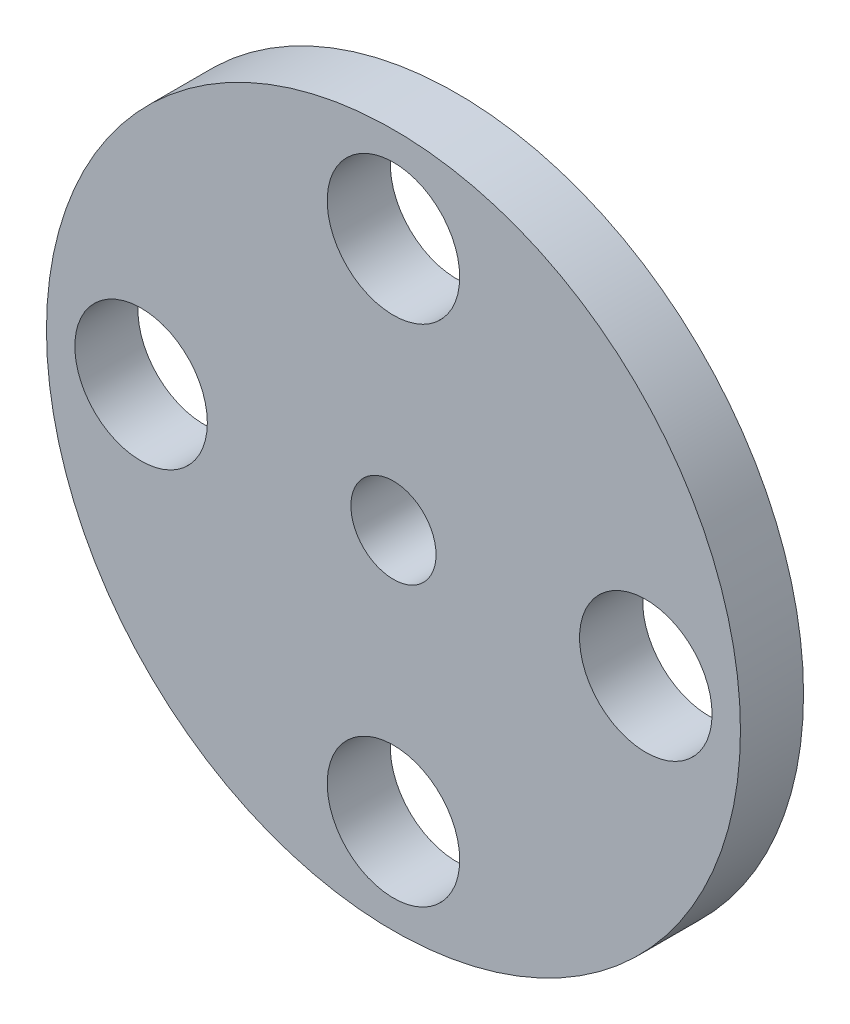
ISO-10303-21;
HEADER;
FILE_DESCRIPTION(('STEP AP214'),'2;1');
FILE_NAME('part.step','',(''),(''),'','','');
FILE_SCHEMA(('AUTOMOTIVE_DESIGN { 1 0 10303 214 1 1 1 1 }'));
ENDSEC;
DATA;
#1=APPLICATION_CONTEXT('core data for automotive mechanical design processes');
#2=APPLICATION_PROTOCOL_DEFINITION('international standard','automotive_design',2000,#1);
#3=PRODUCT_CONTEXT('',#1,'mechanical');
#4=PRODUCT('Part','Part','',(#3));
#5=PRODUCT_RELATED_PRODUCT_CATEGORY('part','',(#4));
#6=PRODUCT_DEFINITION_FORMATION('','',#4);
#7=PRODUCT_DEFINITION_CONTEXT('part definition',#1,'design');
#8=PRODUCT_DEFINITION('design','',#6,#7);
#9=PRODUCT_DEFINITION_SHAPE('','',#8);
#10=(LENGTH_UNIT() NAMED_UNIT(*) SI_UNIT(.MILLI.,.METRE.));
#11=(NAMED_UNIT(*) PLANE_ANGLE_UNIT() SI_UNIT($,.RADIAN.));
#12=(NAMED_UNIT(*) SI_UNIT($,.STERADIAN.) SOLID_ANGLE_UNIT());
#13=UNCERTAINTY_MEASURE_WITH_UNIT(LENGTH_MEASURE(1.E-05),#10,'distance_accuracy_value','');
#14=(GEOMETRIC_REPRESENTATION_CONTEXT(3) GLOBAL_UNCERTAINTY_ASSIGNED_CONTEXT((#13)) GLOBAL_UNIT_ASSIGNED_CONTEXT((#10,
#11,#12)) REPRESENTATION_CONTEXT('',''));
#15=CARTESIAN_POINT('',(0.,0.,0.));
#16=DIRECTION('',(0.,0.,1.));
#17=DIRECTION('',(1.,0.,0.));
#18=AXIS2_PLACEMENT_3D('',#15,#16,#17);
#19=CARTESIAN_POINT('',(0.,0.,2.));
#20=DIRECTION('',(0.,0.,1.));
#21=DIRECTION('',(1.,0.,0.));
#22=AXIS2_PLACEMENT_3D('',#19,#20,#21);
#23=PLANE('',#22);
#24=CARTESIAN_POINT('',(-8.00000000000001,0.,2.));
#25=DIRECTION('',(0.,0.,1.));
#26=DIRECTION('',(1.,0.,0.));
#27=AXIS2_PLACEMENT_3D('',#24,#25,#26);
#28=CIRCLE('',#27,2.1);
#29=CARTESIAN_POINT('',(-5.90000000000001,0.,2.));
#30=VERTEX_POINT('',#29);
#31=EDGE_CURVE('E58',#30,#30,#28,.T.);
#32=ORIENTED_EDGE('',*,*,#31,.F.);
#33=EDGE_LOOP('',(#32));
#34=FACE_BOUND('',#33,.T.);
#35=CARTESIAN_POINT('',(8.00000000000001,0.,2.));
#36=DIRECTION('',(0.,0.,1.));
#37=DIRECTION('',(1.,0.,0.));
#38=AXIS2_PLACEMENT_3D('',#35,#36,#37);
#39=CIRCLE('',#38,2.1);
#40=CARTESIAN_POINT('',(10.1,0.,2.));
#41=VERTEX_POINT('',#40);
#42=EDGE_CURVE('E46',#41,#41,#39,.T.);
#43=ORIENTED_EDGE('',*,*,#42,.F.);
#44=EDGE_LOOP('',(#43));
#45=FACE_BOUND('',#44,.T.);
#46=CARTESIAN_POINT('',(0.,0.,2.));
#47=DIRECTION('',(0.,0.,1.));
#48=DIRECTION('',(1.,0.,0.));
#49=AXIS2_PLACEMENT_3D('',#46,#47,#48);
#50=CIRCLE('',#49,11.0000000000001);
#51=CARTESIAN_POINT('',(11.0000000000001,0.,2.));
#52=VERTEX_POINT('',#51);
#53=EDGE_CURVE('E10',#52,#52,#50,.T.);
#54=ORIENTED_EDGE('',*,*,#53,.T.);
#55=EDGE_LOOP('',(#54));
#56=FACE_BOUND('',#55,.T.);
#57=CARTESIAN_POINT('',(0.,8.00000000000001,2.));
#58=DIRECTION('',(0.,0.,1.));
#59=DIRECTION('',(1.,0.,0.));
#60=AXIS2_PLACEMENT_3D('',#57,#58,#59);
#61=CIRCLE('',#60,2.1);
#62=CARTESIAN_POINT('',(2.1,8.00000000000001,2.));
#63=VERTEX_POINT('',#62);
#64=EDGE_CURVE('E41',#63,#63,#61,.T.);
#65=ORIENTED_EDGE('',*,*,#64,.F.);
#66=EDGE_LOOP('',(#65));
#67=FACE_BOUND('',#66,.T.);
#68=CARTESIAN_POINT('',(0.,-8.00000000000001,2.));
#69=DIRECTION('',(0.,0.,1.));
#70=DIRECTION('',(1.,0.,0.));
#71=AXIS2_PLACEMENT_3D('',#68,#69,#70);
#72=CIRCLE('',#71,2.1);
#73=CARTESIAN_POINT('',(2.1,-8.00000000000001,2.));
#74=VERTEX_POINT('',#73);
#75=EDGE_CURVE('E52',#74,#74,#72,.T.);
#76=ORIENTED_EDGE('',*,*,#75,.F.);
#77=EDGE_LOOP('',(#76));
#78=FACE_BOUND('',#77,.T.);
#79=CARTESIAN_POINT('',(0.,0.,2.));
#80=DIRECTION('',(0.,0.,1.));
#81=DIRECTION('',(1.,0.,0.));
#82=AXIS2_PLACEMENT_3D('',#79,#80,#81);
#83=CIRCLE('',#82,1.35);
#84=CARTESIAN_POINT('',(1.35,0.,2.));
#85=VERTEX_POINT('',#84);
#86=EDGE_CURVE('E64',#85,#85,#83,.T.);
#87=ORIENTED_EDGE('',*,*,#86,.F.);
#88=EDGE_LOOP('',(#87));
#89=FACE_BOUND('',#88,.T.);
#90=ADVANCED_FACE('F30',(#34,#45,#56,#67,#78,#89),#23,.T.);
#91=CARTESIAN_POINT('',(0.,0.,0.));
#92=DIRECTION('',(0.,0.,1.));
#93=DIRECTION('',(1.,0.,0.));
#94=AXIS2_PLACEMENT_3D('',#91,#92,#93);
#95=PLANE('',#94);
#96=CARTESIAN_POINT('',(-8.00000000000001,0.,0.));
#97=DIRECTION('',(0.,0.,1.));
#98=DIRECTION('',(1.,0.,0.));
#99=AXIS2_PLACEMENT_3D('',#96,#97,#98);
#100=CIRCLE('',#99,2.1);
#101=CARTESIAN_POINT('',(-5.90000000000001,0.,0.));
#102=VERTEX_POINT('',#101);
#103=EDGE_CURVE('E61',#102,#102,#100,.T.);
#104=ORIENTED_EDGE('',*,*,#103,.T.);
#105=EDGE_LOOP('',(#104));
#106=FACE_BOUND('',#105,.T.);
#107=CARTESIAN_POINT('',(8.00000000000001,0.,0.));
#108=DIRECTION('',(0.,0.,1.));
#109=DIRECTION('',(1.,0.,0.));
#110=AXIS2_PLACEMENT_3D('',#107,#108,#109);
#111=CIRCLE('',#110,2.1);
#112=CARTESIAN_POINT('',(10.1,0.,0.));
#113=VERTEX_POINT('',#112);
#114=EDGE_CURVE('E49',#113,#113,#111,.T.);
#115=ORIENTED_EDGE('',*,*,#114,.T.);
#116=EDGE_LOOP('',(#115));
#117=FACE_BOUND('',#116,.T.);
#118=CARTESIAN_POINT('',(0.,0.,0.));
#119=DIRECTION('',(0.,0.,1.));
#120=DIRECTION('',(1.,0.,0.));
#121=AXIS2_PLACEMENT_3D('',#118,#119,#120);
#122=CIRCLE('',#121,11.0000000000001);
#123=CARTESIAN_POINT('',(11.0000000000001,0.,0.));
#124=VERTEX_POINT('',#123);
#125=EDGE_CURVE('E34',#124,#124,#122,.T.);
#126=ORIENTED_EDGE('',*,*,#125,.F.);
#127=EDGE_LOOP('',(#126));
#128=FACE_BOUND('',#127,.T.);
#129=CARTESIAN_POINT('',(0.,8.00000000000001,0.));
#130=DIRECTION('',(0.,0.,1.));
#131=DIRECTION('',(1.,0.,0.));
#132=AXIS2_PLACEMENT_3D('',#129,#130,#131);
#133=CIRCLE('',#132,2.1);
#134=CARTESIAN_POINT('',(2.1,8.00000000000001,0.));
#135=VERTEX_POINT('',#134);
#136=EDGE_CURVE('E43',#135,#135,#133,.T.);
#137=ORIENTED_EDGE('',*,*,#136,.T.);
#138=EDGE_LOOP('',(#137));
#139=FACE_BOUND('',#138,.T.);
#140=CARTESIAN_POINT('',(0.,-8.00000000000001,0.));
#141=DIRECTION('',(0.,0.,1.));
#142=DIRECTION('',(1.,0.,0.));
#143=AXIS2_PLACEMENT_3D('',#140,#141,#142);
#144=CIRCLE('',#143,2.1);
#145=CARTESIAN_POINT('',(2.1,-8.00000000000001,0.));
#146=VERTEX_POINT('',#145);
#147=EDGE_CURVE('E55',#146,#146,#144,.T.);
#148=ORIENTED_EDGE('',*,*,#147,.T.);
#149=EDGE_LOOP('',(#148));
#150=FACE_BOUND('',#149,.T.);
#151=CARTESIAN_POINT('',(0.,0.,0.));
#152=DIRECTION('',(0.,0.,1.));
#153=DIRECTION('',(1.,0.,0.));
#154=AXIS2_PLACEMENT_3D('',#151,#152,#153);
#155=CIRCLE('',#154,1.35);
#156=CARTESIAN_POINT('',(1.35,0.,0.));
#157=VERTEX_POINT('',#156);
#158=EDGE_CURVE('E67',#157,#157,#155,.T.);
#159=ORIENTED_EDGE('',*,*,#158,.T.);
#160=EDGE_LOOP('',(#159));
#161=FACE_BOUND('',#160,.T.);
#162=ADVANCED_FACE('F77',(#106,#117,#128,#139,#150,#161),#95,.F.);
#163=CARTESIAN_POINT('',(0.,0.,2.));
#164=DIRECTION('',(0.,0.,-1.));
#165=DIRECTION('',(-1.,0.,0.));
#166=AXIS2_PLACEMENT_3D('',#163,#164,#165);
#167=CYLINDRICAL_SURFACE('',#166,11.0000000000001);
#168=ORIENTED_EDGE('',*,*,#53,.F.);
#169=EDGE_LOOP('',(#168));
#170=FACE_BOUND('',#169,.T.);
#171=ORIENTED_EDGE('',*,*,#125,.T.);
#172=EDGE_LOOP('',(#171));
#173=FACE_BOUND('',#172,.T.);
#174=ADVANCED_FACE('F32',(#170,#173),#167,.T.);
#175=CARTESIAN_POINT('',(0.,8.00000000000001,2.));
#176=DIRECTION('',(0.,0.,-1.));
#177=DIRECTION('',(-1.,0.,0.));
#178=AXIS2_PLACEMENT_3D('',#175,#176,#177);
#179=CYLINDRICAL_SURFACE('',#178,2.1);
#180=ORIENTED_EDGE('',*,*,#64,.T.);
#181=EDGE_LOOP('',(#180));
#182=FACE_BOUND('',#181,.T.);
#183=ORIENTED_EDGE('',*,*,#136,.F.);
#184=EDGE_LOOP('',(#183));
#185=FACE_BOUND('',#184,.T.);
#186=ADVANCED_FACE('F87',(#182,#185),#179,.F.);
#187=CARTESIAN_POINT('',(8.00000000000001,0.,2.));
#188=DIRECTION('',(0.,0.,-1.));
#189=DIRECTION('',(-1.,0.,0.));
#190=AXIS2_PLACEMENT_3D('',#187,#188,#189);
#191=CYLINDRICAL_SURFACE('',#190,2.1);
#192=ORIENTED_EDGE('',*,*,#42,.T.);
#193=EDGE_LOOP('',(#192));
#194=FACE_BOUND('',#193,.T.);
#195=ORIENTED_EDGE('',*,*,#114,.F.);
#196=EDGE_LOOP('',(#195));
#197=FACE_BOUND('',#196,.T.);
#198=ADVANCED_FACE('F90',(#194,#197),#191,.F.);
#199=CARTESIAN_POINT('',(0.,-8.00000000000001,2.));
#200=DIRECTION('',(0.,0.,-1.));
#201=DIRECTION('',(-1.,0.,0.));
#202=AXIS2_PLACEMENT_3D('',#199,#200,#201);
#203=CYLINDRICAL_SURFACE('',#202,2.1);
#204=ORIENTED_EDGE('',*,*,#75,.T.);
#205=EDGE_LOOP('',(#204));
#206=FACE_BOUND('',#205,.T.);
#207=ORIENTED_EDGE('',*,*,#147,.F.);
#208=EDGE_LOOP('',(#207));
#209=FACE_BOUND('',#208,.T.);
#210=ADVANCED_FACE('F94',(#206,#209),#203,.F.);
#211=CARTESIAN_POINT('',(-8.00000000000001,0.,2.));
#212=DIRECTION('',(0.,0.,-1.));
#213=DIRECTION('',(-1.,0.,0.));
#214=AXIS2_PLACEMENT_3D('',#211,#212,#213);
#215=CYLINDRICAL_SURFACE('',#214,2.1);
#216=ORIENTED_EDGE('',*,*,#31,.T.);
#217=EDGE_LOOP('',(#216));
#218=FACE_BOUND('',#217,.T.);
#219=ORIENTED_EDGE('',*,*,#103,.F.);
#220=EDGE_LOOP('',(#219));
#221=FACE_BOUND('',#220,.T.);
#222=ADVANCED_FACE('F98',(#218,#221),#215,.F.);
#223=CARTESIAN_POINT('',(0.,0.,2.));
#224=DIRECTION('',(0.,0.,-1.));
#225=DIRECTION('',(-1.,0.,0.));
#226=AXIS2_PLACEMENT_3D('',#223,#224,#225);
#227=CYLINDRICAL_SURFACE('',#226,1.35);
#228=ORIENTED_EDGE('',*,*,#86,.T.);
#229=EDGE_LOOP('',(#228));
#230=FACE_BOUND('',#229,.T.);
#231=ORIENTED_EDGE('',*,*,#158,.F.);
#232=EDGE_LOOP('',(#231));
#233=FACE_BOUND('',#232,.T.);
#234=ADVANCED_FACE('F73',(#230,#233),#227,.F.);
#235=CLOSED_SHELL('',(#90,#162,#174,#186,#198,#210,#222,#234));
#236=MANIFOLD_SOLID_BREP('B2',#235);
#237=ADVANCED_BREP_SHAPE_REPRESENTATION('',(#18,#236),#14);
#238=SHAPE_DEFINITION_REPRESENTATION(#9,#237);
ENDSEC;
END-ISO-10303-21;
